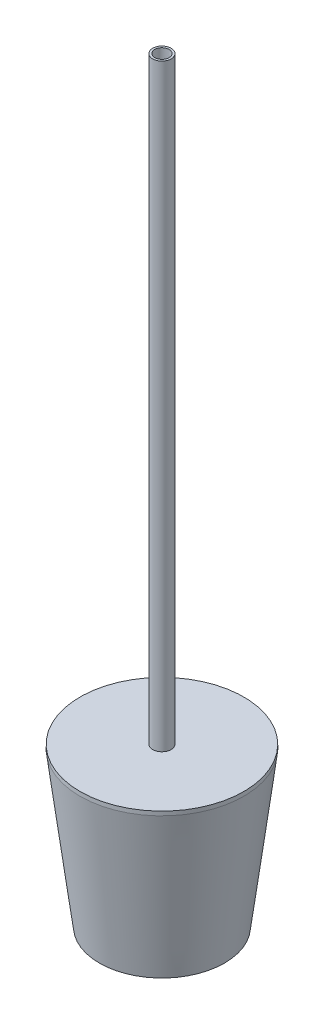
ISO-10303-21;
HEADER;
FILE_DESCRIPTION(('STEP AP214'),'2;1');
FILE_NAME('part.step','',(''),(''),'','','');
FILE_SCHEMA(('AUTOMOTIVE_DESIGN { 1 0 10303 214 1 1 1 1 }'));
ENDSEC;
DATA;
#1=APPLICATION_CONTEXT('core data for automotive mechanical design processes');
#2=APPLICATION_PROTOCOL_DEFINITION('international standard','automotive_design',2000,#1);
#3=PRODUCT_CONTEXT('',#1,'mechanical');
#4=PRODUCT('Part','Part','',(#3));
#5=PRODUCT_RELATED_PRODUCT_CATEGORY('part','',(#4));
#6=PRODUCT_DEFINITION_FORMATION('','',#4);
#7=PRODUCT_DEFINITION_CONTEXT('part definition',#1,'design');
#8=PRODUCT_DEFINITION('design','',#6,#7);
#9=PRODUCT_DEFINITION_SHAPE('','',#8);
#10=(LENGTH_UNIT() NAMED_UNIT(*) SI_UNIT(.MILLI.,.METRE.));
#11=(NAMED_UNIT(*) PLANE_ANGLE_UNIT() SI_UNIT($,.RADIAN.));
#12=(NAMED_UNIT(*) SI_UNIT($,.STERADIAN.) SOLID_ANGLE_UNIT());
#13=UNCERTAINTY_MEASURE_WITH_UNIT(LENGTH_MEASURE(1.E-05),#10,'distance_accuracy_value','');
#14=(GEOMETRIC_REPRESENTATION_CONTEXT(3) GLOBAL_UNCERTAINTY_ASSIGNED_CONTEXT((#13)) GLOBAL_UNIT_ASSIGNED_CONTEXT((#10,
#11,#12)) REPRESENTATION_CONTEXT('',''));
#15=CARTESIAN_POINT('',(0.,0.,0.));
#16=DIRECTION('',(0.,0.,1.));
#17=DIRECTION('',(1.,0.,0.));
#18=AXIS2_PLACEMENT_3D('',#15,#16,#17);
#19=CARTESIAN_POINT('',(0.,820.166,0.));
#20=DIRECTION('',(0.,-1.,0.));
#21=DIRECTION('',(0.,0.,-1.));
#22=AXIS2_PLACEMENT_3D('',#19,#20,#21);
#23=CYLINDRICAL_SURFACE('',#22,450.388011064221);
#24=CARTESIAN_POINT('',(0.,820.166,0.));
#25=DIRECTION('',(0.,1.,0.));
#26=DIRECTION('',(0.,0.,1.));
#27=AXIS2_PLACEMENT_3D('',#24,#25,#26);
#28=CIRCLE('',#27,450.388011064221);
#29=CARTESIAN_POINT('',(0.,820.166,450.388011064221));
#30=VERTEX_POINT('',#29);
#31=EDGE_CURVE('E58',#30,#30,#28,.T.);
#32=ORIENTED_EDGE('',*,*,#31,.F.);
#33=EDGE_LOOP('',(#32));
#34=FACE_BOUND('',#33,.T.);
#35=CARTESIAN_POINT('',(0.,797.56,0.));
#36=DIRECTION('',(0.,1.,0.));
#37=DIRECTION('',(0.,0.,1.));
#38=AXIS2_PLACEMENT_3D('',#35,#36,#37);
#39=CIRCLE('',#38,450.388011064221);
#40=CARTESIAN_POINT('',(0.,797.56,450.388011064221));
#41=VERTEX_POINT('',#40);
#42=EDGE_CURVE('E63',#41,#41,#39,.T.);
#43=ORIENTED_EDGE('',*,*,#42,.T.);
#44=EDGE_LOOP('',(#43));
#45=FACE_BOUND('',#44,.T.);
#46=ADVANCED_FACE('F37',(#34,#45),#23,.T.);
#47=CARTESIAN_POINT('',(0.,820.166,0.));
#48=DIRECTION('',(0.,1.,0.));
#49=DIRECTION('',(0.,0.,1.));
#50=AXIS2_PLACEMENT_3D('',#47,#48,#49);
#51=PLANE('',#50);
#52=CARTESIAN_POINT('',(0.,820.166,0.));
#53=DIRECTION('',(0.,1.,0.));
#54=DIRECTION('',(0.,0.,1.));
#55=AXIS2_PLACEMENT_3D('',#52,#53,#54);
#56=CIRCLE('',#55,50.8);
#57=CARTESIAN_POINT('',(0.,820.166,50.8));
#58=VERTEX_POINT('',#57);
#59=EDGE_CURVE('E10',#58,#58,#56,.T.);
#60=ORIENTED_EDGE('',*,*,#59,.F.);
#61=EDGE_LOOP('',(#60));
#62=FACE_BOUND('',#61,.T.);
#63=ORIENTED_EDGE('',*,*,#31,.T.);
#64=EDGE_LOOP('',(#63));
#65=FACE_BOUND('',#64,.T.);
#66=ADVANCED_FACE('F102',(#62,#65),#51,.T.);
#67=CARTESIAN_POINT('',(0.,797.56,0.));
#68=DIRECTION('',(0.,1.,0.));
#69=DIRECTION('',(0.,0.,1.));
#70=AXIS2_PLACEMENT_3D('',#67,#68,#69);
#71=PLANE('',#70);
#72=CARTESIAN_POINT('',(0.,797.56,0.));
#73=DIRECTION('',(0.,1.,0.));
#74=DIRECTION('',(0.,0.,1.));
#75=AXIS2_PLACEMENT_3D('',#72,#73,#74);
#76=CIRCLE('',#75,450.084112184143);
#77=CARTESIAN_POINT('',(0.,797.56,450.084112184143));
#78=VERTEX_POINT('',#77);
#79=EDGE_CURVE('E56',#78,#78,#76,.F.);
#80=ORIENTED_EDGE('',*,*,#79,.F.);
#81=EDGE_LOOP('',(#80));
#82=FACE_BOUND('',#81,.T.);
#83=ORIENTED_EDGE('',*,*,#42,.F.);
#84=EDGE_LOOP('',(#83));
#85=FACE_BOUND('',#84,.T.);
#86=ADVANCED_FACE('F110',(#82,#85),#71,.F.);
#87=CARTESIAN_POINT('',(0.,-50.000000076,0.));
#88=DIRECTION('',(0.,-1.,0.));
#89=DIRECTION('',(1.,0.,0.));
#90=AXIS2_PLACEMENT_3D('',#87,#88,#89);
#91=PLANE('',#90);
#92=CARTESIAN_POINT('',(0.,-50.000000076,0.));
#93=DIRECTION('',(0.,-1.,0.));
#94=DIRECTION('',(1.,0.,0.));
#95=AXIS2_PLACEMENT_3D('',#92,#93,#94);
#96=CIRCLE('',#95,344.139110806);
#97=CARTESIAN_POINT('',(344.139110806,-50.000000076,0.));
#98=VERTEX_POINT('',#97);
#99=EDGE_CURVE('E48',#98,#98,#96,.T.);
#100=ORIENTED_EDGE('',*,*,#99,.T.);
#101=EDGE_LOOP('',(#100));
#102=FACE_BOUND('',#101,.T.);
#103=ADVANCED_FACE('F116',(#102),#91,.T.);
#104=CARTESIAN_POINT('',(0.,-50.000000076,0.));
#105=DIRECTION('',(0.,1.,0.));
#106=DIRECTION('',(-1.,0.,0.));
#107=AXIS2_PLACEMENT_3D('',#104,#105,#106);
#108=CONICAL_SURFACE('',#107,344.139110806,0.124354996136722);
#109=ORIENTED_EDGE('',*,*,#99,.F.);
#110=EDGE_LOOP('',(#109));
#111=FACE_BOUND('',#110,.T.);
#112=ORIENTED_EDGE('',*,*,#79,.T.);
#113=EDGE_LOOP('',(#112));
#114=FACE_BOUND('',#113,.T.);
#115=ADVANCED_FACE('F119',(#111,#114),#108,.T.);
#116=CARTESIAN_POINT('',(0.,467.36,0.));
#117=DIRECTION('',(0.,1.,0.));
#118=DIRECTION('',(0.,0.,1.));
#119=AXIS2_PLACEMENT_3D('',#116,#117,#118);
#120=CYLINDRICAL_SURFACE('',#119,50.8);
#121=CARTESIAN_POINT('',(0.,467.36,0.));
#122=DIRECTION('',(0.,1.,0.));
#123=DIRECTION('',(0.,0.,1.));
#124=AXIS2_PLACEMENT_3D('',#121,#122,#123);
#125=CIRCLE('',#124,50.8);
#126=CARTESIAN_POINT('',(0.,467.36,50.8));
#127=VERTEX_POINT('',#126);
#128=EDGE_CURVE('E73',#127,#127,#125,.T.);
#129=ORIENTED_EDGE('',*,*,#128,.T.);
#130=EDGE_LOOP('',(#129));
#131=FACE_BOUND('',#130,.T.);
#132=CARTESIAN_POINT('',(0.,797.56,0.));
#133=DIRECTION('',(0.,1.,0.));
#134=DIRECTION('',(0.,0.,1.));
#135=AXIS2_PLACEMENT_3D('',#132,#133,#134);
#136=CIRCLE('',#135,50.8);
#137=CARTESIAN_POINT('',(0.,797.56,50.8));
#138=VERTEX_POINT('',#137);
#139=EDGE_CURVE('E68',#138,#138,#136,.T.);
#140=ORIENTED_EDGE('',*,*,#139,.F.);
#141=EDGE_LOOP('',(#140));
#142=FACE_BOUND('',#141,.T.);
#143=ADVANCED_FACE('F122',(#131,#142),#120,.T.);
#144=ORIENTED_EDGE('',*,*,#59,.T.);
#145=EDGE_LOOP('',(#144));
#146=FACE_BOUND('',#145,.T.);
#147=CARTESIAN_POINT('',(0.,4109.212,0.));
#148=DIRECTION('',(0.,1.,0.));
#149=DIRECTION('',(0.,0.,1.));
#150=AXIS2_PLACEMENT_3D('',#147,#148,#149);
#151=CIRCLE('',#150,50.8);
#152=CARTESIAN_POINT('',(0.,4109.212,50.8));
#153=VERTEX_POINT('',#152);
#154=EDGE_CURVE('E79',#153,#153,#151,.T.);
#155=ORIENTED_EDGE('',*,*,#154,.F.);
#156=EDGE_LOOP('',(#155));
#157=FACE_BOUND('',#156,.T.);
#158=ADVANCED_FACE('F157',(#146,#157),#120,.T.);
#159=CARTESIAN_POINT('',(0.,467.36,0.));
#160=DIRECTION('',(0.,1.,0.));
#161=DIRECTION('',(0.,0.,1.));
#162=AXIS2_PLACEMENT_3D('',#159,#160,#161);
#163=PLANE('',#162);
#164=CARTESIAN_POINT('',(0.,467.36,0.));
#165=DIRECTION('',(0.,1.,0.));
#166=DIRECTION('',(0.,0.,1.));
#167=AXIS2_PLACEMENT_3D('',#164,#165,#166);
#168=CIRCLE('',#167,39.37);
#169=CARTESIAN_POINT('',(0.,467.36,39.37));
#170=VERTEX_POINT('',#169);
#171=EDGE_CURVE('E76',#170,#170,#168,.T.);
#172=ORIENTED_EDGE('',*,*,#171,.T.);
#173=EDGE_LOOP('',(#172));
#174=FACE_BOUND('',#173,.T.);
#175=ORIENTED_EDGE('',*,*,#128,.F.);
#176=EDGE_LOOP('',(#175));
#177=FACE_BOUND('',#176,.T.);
#178=ADVANCED_FACE('F98',(#174,#177),#163,.F.);
#179=CARTESIAN_POINT('',(0.,467.36,0.));
#180=DIRECTION('',(0.,1.,0.));
#181=DIRECTION('',(0.,0.,1.));
#182=AXIS2_PLACEMENT_3D('',#179,#180,#181);
#183=CYLINDRICAL_SURFACE('',#182,39.37);
#184=ORIENTED_EDGE('',*,*,#171,.F.);
#185=EDGE_LOOP('',(#184));
#186=FACE_BOUND('',#185,.T.);
#187=CARTESIAN_POINT('',(0.,4109.212,0.));
#188=DIRECTION('',(0.,1.,0.));
#189=DIRECTION('',(0.,0.,1.));
#190=AXIS2_PLACEMENT_3D('',#187,#188,#189);
#191=CIRCLE('',#190,39.37);
#192=CARTESIAN_POINT('',(0.,4109.212,39.37));
#193=VERTEX_POINT('',#192);
#194=EDGE_CURVE('E82',#193,#193,#191,.T.);
#195=ORIENTED_EDGE('',*,*,#194,.T.);
#196=EDGE_LOOP('',(#195));
#197=FACE_BOUND('',#196,.T.);
#198=ADVANCED_FACE('F86',(#186,#197),#183,.F.);
#199=CARTESIAN_POINT('',(0.,4109.212,0.));
#200=DIRECTION('',(0.,1.,0.));
#201=DIRECTION('',(0.,0.,1.));
#202=AXIS2_PLACEMENT_3D('',#199,#200,#201);
#203=PLANE('',#202);
#204=ORIENTED_EDGE('',*,*,#154,.T.);
#205=EDGE_LOOP('',(#204));
#206=FACE_BOUND('',#205,.T.);
#207=ORIENTED_EDGE('',*,*,#194,.F.);
#208=EDGE_LOOP('',(#207));
#209=FACE_BOUND('',#208,.T.);
#210=ADVANCED_FACE('F88',(#206,#209),#203,.T.);
#211=CARTESIAN_POINT('',(0.,0.,0.));
#212=DIRECTION('',(0.,1.,0.));
#213=DIRECTION('',(-1.,0.,0.));
#214=AXIS2_PLACEMENT_3D('',#211,#212,#213);
#215=PLANE('',#214);
#216=CARTESIAN_POINT('',(0.,0.,0.));
#217=DIRECTION('',(0.,-1.,0.));
#218=DIRECTION('',(1.,0.,0.));
#219=AXIS2_PLACEMENT_3D('',#216,#217,#218);
#220=CIRCLE('',#219,299.999999948);
#221=CARTESIAN_POINT('',(299.999999948,0.,0.));
#222=VERTEX_POINT('',#221);
#223=EDGE_CURVE('E44',#222,#222,#220,.T.);
#224=ORIENTED_EDGE('',*,*,#223,.F.);
#225=EDGE_LOOP('',(#224));
#226=FACE_BOUND('',#225,.T.);
#227=ADVANCED_FACE('F39',(#226),#215,.T.);
#228=CARTESIAN_POINT('',(0.,799.999999946,0.));
#229=DIRECTION('',(0.,1.,0.));
#230=DIRECTION('',(-1.,0.,0.));
#231=AXIS2_PLACEMENT_3D('',#228,#229,#230);
#232=CONICAL_SURFACE('',#231,400.000001233093,0.124354996136722);
#233=ORIENTED_EDGE('',*,*,#223,.T.);
#234=EDGE_LOOP('',(#233));
#235=FACE_BOUND('',#234,.T.);
#236=CARTESIAN_POINT('',(0.,797.56,0.));
#237=DIRECTION('',(0.,1.,0.));
#238=DIRECTION('',(0.,0.,1.));
#239=AXIS2_PLACEMENT_3D('',#236,#237,#238);
#240=CIRCLE('',#239,399.695001235903);
#241=CARTESIAN_POINT('',(0.,797.56,399.695001235903));
#242=VERTEX_POINT('',#241);
#243=EDGE_CURVE('E53',#242,#242,#240,.T.);
#244=ORIENTED_EDGE('',*,*,#243,.T.);
#245=EDGE_LOOP('',(#244));
#246=FACE_BOUND('',#245,.T.);
#247=ADVANCED_FACE('F96',(#235,#246),#232,.F.);
#248=ORIENTED_EDGE('',*,*,#139,.T.);
#249=EDGE_LOOP('',(#248));
#250=FACE_BOUND('',#249,.T.);
#251=ORIENTED_EDGE('',*,*,#243,.F.);
#252=EDGE_LOOP('',(#251));
#253=FACE_BOUND('',#252,.T.);
#254=ADVANCED_FACE('F125',(#250,#253),#71,.F.);
#255=CLOSED_SHELL('',(#46,#66,#86,#103,#115,#143,#158,#178,#198,#210,#227,#247,#254));
#256=MANIFOLD_SOLID_BREP('B2',#255);
#257=ADVANCED_BREP_SHAPE_REPRESENTATION('',(#18,#256),#14);
#258=SHAPE_DEFINITION_REPRESENTATION(#9,#257);
ENDSEC;
END-ISO-10303-21;
